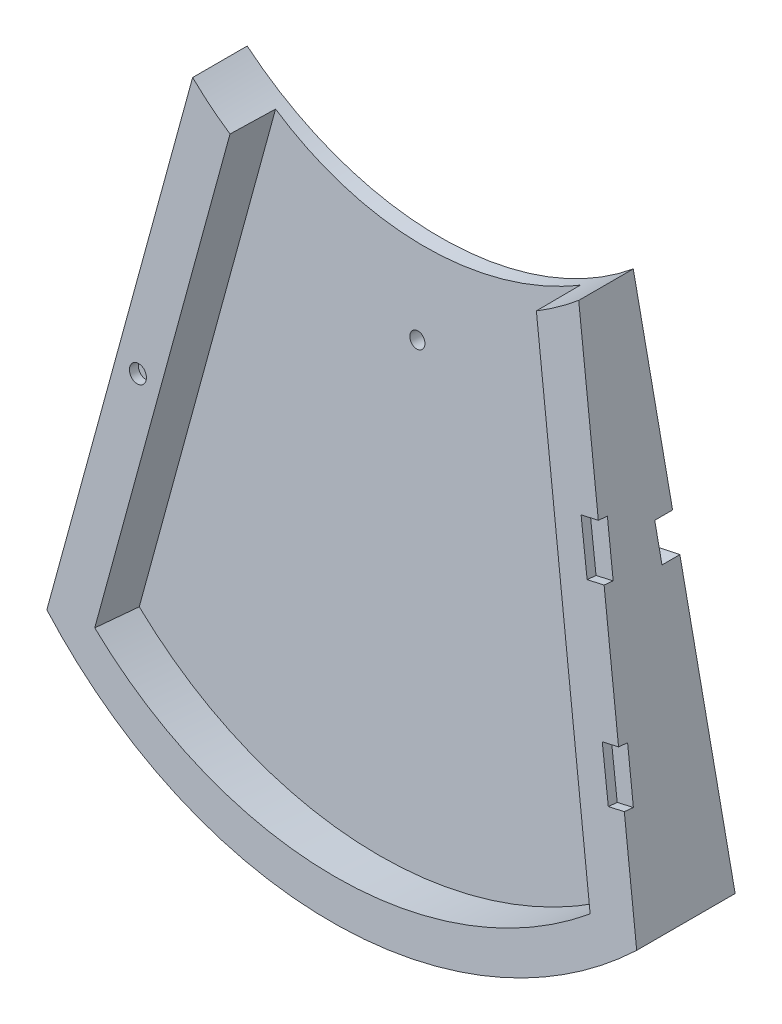
ISO-10303-21;
HEADER;
FILE_DESCRIPTION(('STEP AP214'),'2;1');
FILE_NAME('part.step','',(''),(''),'','','');
FILE_SCHEMA(('AUTOMOTIVE_DESIGN { 1 0 10303 214 1 1 1 1 }'));
ENDSEC;
DATA;
#1=APPLICATION_CONTEXT('core data for automotive mechanical design processes');
#2=APPLICATION_PROTOCOL_DEFINITION('international standard','automotive_design',2000,#1);
#3=PRODUCT_CONTEXT('',#1,'mechanical');
#4=PRODUCT('Part','Part','',(#3));
#5=PRODUCT_RELATED_PRODUCT_CATEGORY('part','',(#4));
#6=PRODUCT_DEFINITION_FORMATION('','',#4);
#7=PRODUCT_DEFINITION_CONTEXT('part definition',#1,'design');
#8=PRODUCT_DEFINITION('design','',#6,#7);
#9=PRODUCT_DEFINITION_SHAPE('','',#8);
#10=(LENGTH_UNIT() NAMED_UNIT(*) SI_UNIT(.MILLI.,.METRE.));
#11=(NAMED_UNIT(*) PLANE_ANGLE_UNIT() SI_UNIT($,.RADIAN.));
#12=(NAMED_UNIT(*) SI_UNIT($,.STERADIAN.) SOLID_ANGLE_UNIT());
#13=UNCERTAINTY_MEASURE_WITH_UNIT(LENGTH_MEASURE(1.E-05),#10,'distance_accuracy_value','');
#14=(GEOMETRIC_REPRESENTATION_CONTEXT(3) GLOBAL_UNCERTAINTY_ASSIGNED_CONTEXT((#13)) GLOBAL_UNIT_ASSIGNED_CONTEXT((#10,
#11,#12)) REPRESENTATION_CONTEXT('',''));
#15=CARTESIAN_POINT('',(0.,0.,0.));
#16=DIRECTION('',(0.,0.,1.));
#17=DIRECTION('',(1.,0.,0.));
#18=AXIS2_PLACEMENT_3D('',#15,#16,#17);
#19=CARTESIAN_POINT('',(104.775,110.670499117877,40.0181550098383));
#20=DIRECTION('',(0.,0.,-1.));
#21=DIRECTION('',(-1.,0.,0.));
#22=AXIS2_PLACEMENT_3D('',#19,#20,#21);
#23=CYLINDRICAL_SURFACE('',#22,152.4);
#24=DIRECTION('',(0.,0.,1.));
#25=VECTOR('',#24,1.);
#26=CARTESIAN_POINT('',(203.2,-5.68361286360829,-3.175));
#27=LINE('',#26,#25);
#28=CARTESIAN_POINT('',(203.2,-5.68361286360829,0.));
#29=VERTEX_POINT('',#28);
#30=CARTESIAN_POINT('',(203.2,-5.68361286360829,6.35));
#31=VERTEX_POINT('',#30);
#32=EDGE_CURVE('E290',#29,#31,#27,.T.);
#33=ORIENTED_EDGE('',*,*,#32,.F.);
#34=CARTESIAN_POINT('',(104.775,110.670499117877,0.));
#35=DIRECTION('',(0.,0.,-1.));
#36=DIRECTION('',(-1.,0.,0.));
#37=AXIS2_PLACEMENT_3D('',#34,#35,#36);
#38=CIRCLE('',#37,152.4);
#39=CARTESIAN_POINT('',(209.55,0.,0.));
#40=VERTEX_POINT('',#39);
#41=EDGE_CURVE('E378',#29,#40,#38,.F.);
#42=ORIENTED_EDGE('',*,*,#41,.T.);
#43=DIRECTION('',(0.,0.,-1.));
#44=VECTOR('',#43,1.);
#45=CARTESIAN_POINT('',(209.55,0.,40.0181550098383));
#46=LINE('',#45,#44);
#47=CARTESIAN_POINT('',(209.55,0.,34.9813640995144));
#48=VERTEX_POINT('',#47);
#49=EDGE_CURVE('E369',#48,#40,#46,.T.);
#50=ORIENTED_EDGE('',*,*,#49,.F.);
#51=CARTESIAN_POINT('',(104.775,110.670499117877,25.0649860538345));
#52=DIRECTION('',(0.,-0.0892451798673686,-0.996009687638851));
#53=DIRECTION('',(0.,0.996009687638851,-0.0892451798673686));
#54=AXIS2_PLACEMENT_3D('',#51,#52,#53);
#55=ELLIPSE('',#54,153.01055992867,152.4);
#56=CARTESIAN_POINT('',(0.,0.,34.9813640995144));
#57=VERTEX_POINT('',#56);
#58=EDGE_CURVE('E375',#57,#48,#55,.F.);
#59=ORIENTED_EDGE('',*,*,#58,.F.);
#60=DIRECTION('',(0.,0.,-1.));
#61=VECTOR('',#60,1.);
#62=CARTESIAN_POINT('',(0.,0.,40.0181550098383));
#63=LINE('',#62,#61);
#64=CARTESIAN_POINT('',(0.,0.,0.));
#65=VERTEX_POINT('',#64);
#66=EDGE_CURVE('E359',#57,#65,#63,.T.);
#67=ORIENTED_EDGE('',*,*,#66,.T.);
#68=CARTESIAN_POINT('',(6.34999999999997,-5.68361286360829,0.));
#69=VERTEX_POINT('',#68);
#70=EDGE_CURVE('E397',#65,#69,#38,.F.);
#71=ORIENTED_EDGE('',*,*,#70,.T.);
#72=DIRECTION('',(0.,0.,1.));
#73=VECTOR('',#72,1.);
#74=CARTESIAN_POINT('',(6.34999999999997,-5.68361286360829,-3.175));
#75=LINE('',#74,#73);
#76=CARTESIAN_POINT('',(6.34999999999997,-5.68361286360829,6.35));
#77=VERTEX_POINT('',#76);
#78=EDGE_CURVE('E293',#69,#77,#75,.T.);
#79=ORIENTED_EDGE('',*,*,#78,.T.);
#80=CARTESIAN_POINT('',(104.775,110.670499117877,6.35));
#81=DIRECTION('',(0.,0.,-1.));
#82=DIRECTION('',(0.,1.,0.));
#83=AXIS2_PLACEMENT_3D('',#80,#81,#82);
#84=CIRCLE('',#83,152.4);
#85=EDGE_CURVE('E11',#31,#77,#84,.T.);
#86=ORIENTED_EDGE('',*,*,#85,.F.);
#87=EDGE_LOOP('',(#33,#42,#50,#59,#67,#71,#79,#86));
#88=FACE_BOUND('',#87,.T.);
#89=ADVANCED_FACE('F34',(#88),#23,.T.);
#90=CARTESIAN_POINT('',(209.55,177.8,0.));
#91=DIRECTION('',(0.,0.,1.));
#92=DIRECTION('',(0.,-1.,0.));
#93=AXIS2_PLACEMENT_3D('',#90,#91,#92);
#94=PLANE('',#93);
#95=CARTESIAN_POINT('',(104.775,121.250876589425,0.));
#96=DIRECTION('',(0.,0.,1.));
#97=DIRECTION('',(0.,1.,0.));
#98=AXIS2_PLACEMENT_3D('',#95,#96,#97);
#99=ELLIPSE('',#98,2.67768479875172,2.667);
#100=CARTESIAN_POINT('',(104.775,123.928561388176,0.));
#101=VERTEX_POINT('',#100);
#102=EDGE_CURVE('E277',#101,#101,#99,.T.);
#103=ORIENTED_EDGE('',*,*,#102,.T.);
#104=EDGE_LOOP('',(#103));
#105=FACE_BOUND('',#104,.T.);
#106=DIRECTION('',(0.203571428571429,-0.979060096965139,0.));
#107=VECTOR('',#106,1.);
#108=CARTESIAN_POINT('',(173.355,174.076885240402,0.));
#109=LINE('',#108,#107);
#110=CARTESIAN_POINT('',(187.325,106.889315498492,0.));
#111=VERTEX_POINT('',#110);
#112=CARTESIAN_POINT('',(173.355,174.076885240402,0.));
#113=VERTEX_POINT('',#112);
#114=EDGE_CURVE('E383',#111,#113,#109,.F.);
#115=ORIENTED_EDGE('',*,*,#114,.F.);
#116=DIRECTION('',(0.97906009696514,0.203571428571426,0.));
#117=VECTOR('',#116,1.);
#118=CARTESIAN_POINT('',(176.756046253261,104.691761927064,0.));
#119=LINE('',#118,#117);
#120=CARTESIAN_POINT('',(176.756046253261,104.691761927064,0.));
#121=VERTEX_POINT('',#120);
#122=EDGE_CURVE('E267',#121,#111,#119,.T.);
#123=ORIENTED_EDGE('',*,*,#122,.F.);
#124=DIRECTION('',(-0.203571428571427,0.979060096965139,0.));
#125=VECTOR('',#124,1.);
#126=CARTESIAN_POINT('',(179.341403396118,92.2576986956065,0.));
#127=LINE('',#126,#125);
#128=CARTESIAN_POINT('',(179.341403396118,92.2576986956065,0.));
#129=VERTEX_POINT('',#128);
#130=EDGE_CURVE('E716',#129,#121,#127,.T.);
#131=ORIENTED_EDGE('',*,*,#130,.F.);
#132=DIRECTION('',(-0.97906009696514,-0.203571428571425,0.));
#133=VECTOR('',#132,1.);
#134=CARTESIAN_POINT('',(189.910357142857,94.455252267035,0.));
#135=LINE('',#134,#133);
#136=CARTESIAN_POINT('',(189.910357142857,94.455252267035,0.));
#137=VERTEX_POINT('',#136);
#138=EDGE_CURVE('E714',#137,#129,#135,.T.);
#139=ORIENTED_EDGE('',*,*,#138,.F.);
#140=EDGE_CURVE('E240',#40,#137,#109,.F.);
#141=ORIENTED_EDGE('',*,*,#140,.F.);
#142=ORIENTED_EDGE('',*,*,#41,.F.);
#143=DIRECTION('',(0.,1.,0.));
#144=VECTOR('',#143,1.);
#145=CARTESIAN_POINT('',(203.200000000001,177.8,0.));
#146=LINE('',#145,#144);
#147=CARTESIAN_POINT('',(203.2,0.66638713639168,0.));
#148=VERTEX_POINT('',#147);
#149=EDGE_CURVE('E42',#29,#148,#146,.T.);
#150=ORIENTED_EDGE('',*,*,#149,.T.);
#151=CARTESIAN_POINT('',(104.775,110.670499117877,0.));
#152=DIRECTION('',(0.,0.,1.));
#153=DIRECTION('',(0.,-1.,0.));
#154=AXIS2_PLACEMENT_3D('',#151,#152,#153);
#155=CIRCLE('',#154,147.608892949697);
#156=CARTESIAN_POINT('',(6.34999999999997,0.666387136391708,0.));
#157=VERTEX_POINT('',#156);
#158=EDGE_CURVE('E423',#148,#157,#155,.F.);
#159=ORIENTED_EDGE('',*,*,#158,.T.);
#160=DIRECTION('',(0.,-1.,0.));
#161=VECTOR('',#160,1.);
#162=CARTESIAN_POINT('',(6.34999999999997,177.8,0.));
#163=LINE('',#162,#161);
#164=EDGE_CURVE('E426',#157,#69,#163,.T.);
#165=ORIENTED_EDGE('',*,*,#164,.T.);
#166=ORIENTED_EDGE('',*,*,#70,.F.);
#167=DIRECTION('',(0.203571428571428,0.979060096965139,0.));
#168=VECTOR('',#167,1.);
#169=CARTESIAN_POINT('',(0.,0.,0.));
#170=LINE('',#169,#168);
#171=CARTESIAN_POINT('',(19.6396428571428,94.455252267035,0.));
#172=VERTEX_POINT('',#171);
#173=EDGE_CURVE('E374',#172,#65,#170,.F.);
#174=ORIENTED_EDGE('',*,*,#173,.F.);
#175=DIRECTION('',(-0.97906009696514,0.203571428571425,0.));
#176=VECTOR('',#175,1.);
#177=CARTESIAN_POINT('',(19.6396428571428,94.455252267035,0.));
#178=LINE('',#177,#176);
#179=CARTESIAN_POINT('',(30.2085966038816,92.2576986956065,0.));
#180=VERTEX_POINT('',#179);
#181=EDGE_CURVE('E261',#180,#172,#178,.T.);
#182=ORIENTED_EDGE('',*,*,#181,.F.);
#183=DIRECTION('',(-0.203571428571427,-0.979060096965139,0.));
#184=VECTOR('',#183,1.);
#185=CARTESIAN_POINT('',(30.2085966038816,92.2576986956065,0.));
#186=LINE('',#185,#184);
#187=CARTESIAN_POINT('',(32.7939537467387,104.691761927064,0.));
#188=VERTEX_POINT('',#187);
#189=EDGE_CURVE('E258',#188,#180,#186,.T.);
#190=ORIENTED_EDGE('',*,*,#189,.F.);
#191=DIRECTION('',(0.97906009696514,-0.203571428571426,0.));
#192=VECTOR('',#191,1.);
#193=CARTESIAN_POINT('',(32.7939537467387,104.691761927064,0.));
#194=LINE('',#193,#192);
#195=CARTESIAN_POINT('',(22.225,106.889315498492,0.));
#196=VERTEX_POINT('',#195);
#197=EDGE_CURVE('E250',#196,#188,#194,.T.);
#198=ORIENTED_EDGE('',*,*,#197,.F.);
#199=CARTESIAN_POINT('',(36.195,174.076885240402,0.));
#200=VERTEX_POINT('',#199);
#201=EDGE_CURVE('E379',#200,#196,#170,.F.);
#202=ORIENTED_EDGE('',*,*,#201,.F.);
#203=CARTESIAN_POINT('',(104.775,257.443461876365,0.));
#204=DIRECTION('',(0.,0.,-1.));
#205=DIRECTION('',(-1.,0.,0.));
#206=AXIS2_PLACEMENT_3D('',#203,#204,#205);
#207=CIRCLE('',#206,107.95);
#208=EDGE_CURVE('E393',#113,#200,#207,.T.);
#209=ORIENTED_EDGE('',*,*,#208,.F.);
#210=EDGE_LOOP('',(#115,#123,#131,#139,#141,#142,#150,#159,#165,#166,#174,#182,#190,#198,#202,#209));
#211=FACE_BOUND('',#210,.T.);
#212=ADVANCED_FACE('F36',(#105,#211),#94,.F.);
#213=CARTESIAN_POINT('',(209.55,0.709477537812276,34.9177929804182));
#214=DIRECTION('',(0.,-0.0892451798673686,-0.996009687638851));
#215=DIRECTION('',(0.,0.996009687638851,-0.0892451798673686));
#216=AXIS2_PLACEMENT_3D('',#213,#214,#215);
#217=PLANE('',#216);
#218=CARTESIAN_POINT('',(25.0570584627806,81.5250758393471,27.676495334401));
#219=DIRECTION('',(0.,0.0892451798673686,0.996009687638851));
#220=DIRECTION('',(0.,-0.996009687638851,0.0892451798673686));
#221=AXIS2_PLACEMENT_3D('',#218,#219,#220);
#222=CIRCLE('',#221,3.00000000000001);
#223=CARTESIAN_POINT('',(25.0570584627806,78.5370467764305,27.9442308740031));
#224=VERTEX_POINT('',#223);
#225=EDGE_CURVE('E292',#224,#224,#222,.T.);
#226=ORIENTED_EDGE('',*,*,#225,.F.);
#227=EDGE_LOOP('',(#226));
#228=FACE_BOUND('',#227,.T.);
#229=DIRECTION('',(-0.202792585399185,0.975314314577656,-0.0873908180933912));
#230=VECTOR('',#229,1.);
#231=CARTESIAN_POINT('',(209.408548292139,0.680300392770384,34.9204073320551));
#232=LINE('',#231,#230);
#233=CARTESIAN_POINT('',(198.219747424456,54.4919209100059,30.0987396197661));
#234=VERTEX_POINT('',#233);
#235=CARTESIAN_POINT('',(189.205476207381,97.8453193401935,26.2141570812811));
#236=VERTEX_POINT('',#235);
#237=EDGE_CURVE('E384',#234,#236,#232,.T.);
#238=ORIENTED_EDGE('',*,*,#237,.T.);
#239=DIRECTION('',(0.978072988710393,0.207431371561024,-0.0185864156692931));
#240=VECTOR('',#239,1.);
#241=CARTESIAN_POINT('',(183.288614458353,96.5904613059724,26.3265957777737));
#242=LINE('',#241,#240);
#243=CARTESIAN_POINT('',(183.288614458353,96.5904613059724,26.3265957777737));
#244=VERTEX_POINT('',#243);
#245=EDGE_CURVE('E308',#244,#236,#242,.T.);
#246=ORIENTED_EDGE('',*,*,#245,.F.);
#247=DIRECTION('',(0.208262403604486,-0.974170171973437,0.0872882998008739));
#248=VECTOR('',#247,1.);
#249=CARTESIAN_POINT('',(179.585708922266,113.91120696366,24.7746098073142));
#250=LINE('',#249,#248);
#251=CARTESIAN_POINT('',(179.585708922266,113.91120696366,24.7746098073142));
#252=VERTEX_POINT('',#251);
#253=EDGE_CURVE('E316',#252,#244,#250,.T.);
#254=ORIENTED_EDGE('',*,*,#253,.F.);
#255=DIRECTION('',(-0.978072988710394,-0.207431371561021,0.0185864156692931));
#256=VECTOR('',#255,1.);
#257=CARTESIAN_POINT('',(185.9701727393,115.265234834316,24.6532852234654));
#258=LINE('',#257,#256);
#259=CARTESIAN_POINT('',(185.599767720551,115.186678712268,24.6603240658871));
#260=VERTEX_POINT('',#259);
#261=EDGE_CURVE('E314',#260,#252,#258,.T.);
#262=ORIENTED_EDGE('',*,*,#261,.F.);
#263=CARTESIAN_POINT('',(173.355,174.076885240402,19.3836012194569));
#264=VERTEX_POINT('',#263);
#265=EDGE_CURVE('E385',#260,#264,#232,.T.);
#266=ORIENTED_EDGE('',*,*,#265,.T.);
#267=CARTESIAN_POINT('',(104.775,257.443461876365,11.9137289690767));
#268=DIRECTION('',(0.,-0.0892451798673686,-0.996009687638851));
#269=DIRECTION('',(0.,0.996009687638851,-0.0892451798673686));
#270=AXIS2_PLACEMENT_3D('',#267,#268,#269);
#271=ELLIPSE('',#270,108.382479949474,107.95);
#272=CARTESIAN_POINT('',(159.193943589174,164.213739798917,20.2673659055917));
#273=VERTEX_POINT('',#272);
#274=EDGE_CURVE('E386',#264,#273,#271,.T.);
#275=ORIENTED_EDGE('',*,*,#274,.T.);
#276=DIRECTION('',(-0.202792585399185,0.975314314577655,-0.0873908180933912));
#277=VECTOR('',#276,1.);
#278=CARTESIAN_POINT('',(192.776407619951,2.70163212726763,34.739290505125));
#279=LINE('',#278,#277);
#280=CARTESIAN_POINT('',(192.776407619951,2.70163212726762,34.739290505125));
#281=VERTEX_POINT('',#280);
#282=EDGE_CURVE('E346',#281,#273,#279,.T.);
#283=ORIENTED_EDGE('',*,*,#282,.F.);
#284=CARTESIAN_POINT('',(104.775,110.670499117877,25.0649860538346));
#285=DIRECTION('',(0.,0.0892451798673686,0.996009687638851));
#286=DIRECTION('',(0.,-0.996009687638851,0.0892451798673686));
#287=AXIS2_PLACEMENT_3D('',#284,#285,#286);
#288=CIRCLE('',#287,139.624912350715);
#289=CARTESIAN_POINT('',(16.7735923800494,2.70163212726762,34.739290505125));
#290=VERTEX_POINT('',#289);
#291=EDGE_CURVE('E353',#290,#281,#288,.T.);
#292=ORIENTED_EDGE('',*,*,#291,.F.);
#293=DIRECTION('',(-0.202792585399184,-0.975314314577656,0.0873908180933912));
#294=VECTOR('',#293,1.);
#295=CARTESIAN_POINT('',(92.0294252752799,364.638390977217,2.30877145992429));
#296=LINE('',#295,#294);
#297=CARTESIAN_POINT('',(50.3560564108256,164.213739798917,20.2673659055917));
#298=VERTEX_POINT('',#297);
#299=EDGE_CURVE('E323',#298,#290,#296,.T.);
#300=ORIENTED_EDGE('',*,*,#299,.F.);
#301=CARTESIAN_POINT('',(36.195,174.076885240402,19.3836012194569));
#302=VERTEX_POINT('',#301);
#303=EDGE_CURVE('E390',#298,#302,#271,.T.);
#304=ORIENTED_EDGE('',*,*,#303,.T.);
#305=DIRECTION('',(-0.202792585399184,-0.975314314577656,0.0873908180933912));
#306=VECTOR('',#305,1.);
#307=CARTESIAN_POINT('',(8.75916039865485,42.1264638629345,31.2067182388539));
#308=LINE('',#307,#306);
#309=EDGE_CURVE('E371',#302,#57,#308,.T.);
#310=ORIENTED_EDGE('',*,*,#309,.T.);
#311=ORIENTED_EDGE('',*,*,#58,.T.);
#312=CARTESIAN_POINT('',(201.825455911286,37.1505615379309,31.6525726351602));
#313=VERTEX_POINT('',#312);
#314=EDGE_CURVE('E380',#48,#313,#232,.T.);
#315=ORIENTED_EDGE('',*,*,#314,.T.);
#316=DIRECTION('',(0.978072988710394,0.207431371561019,-0.0185864156692921));
#317=VECTOR('',#316,1.);
#318=CARTESIAN_POINT('',(196.248783834661,35.9678515040655,31.7585466743821));
#319=LINE('',#318,#317);
#320=CARTESIAN_POINT('',(196.248783834661,35.9678515040655,31.7585466743821));
#321=VERTEX_POINT('',#320);
#322=EDGE_CURVE('E329',#321,#313,#319,.T.);
#323=ORIENTED_EDGE('',*,*,#322,.F.);
#324=DIRECTION('',(0.208262403604485,-0.974170171973437,0.0872882998008739));
#325=VECTOR('',#324,1.);
#326=CARTESIAN_POINT('',(192.545878298573,53.2885971617532,30.2065607039225));
#327=LINE('',#326,#325);
#328=CARTESIAN_POINT('',(192.545878298573,53.2885971617532,30.2065607039225));
#329=VERTEX_POINT('',#328);
#330=EDGE_CURVE('E336',#329,#321,#327,.T.);
#331=ORIENTED_EDGE('',*,*,#330,.F.);
#332=DIRECTION('',(-0.978072988710394,-0.207431371561019,0.0185864156692921));
#333=VECTOR('',#332,1.);
#334=CARTESIAN_POINT('',(198.756641776884,54.6057863711657,30.0885369644225));
#335=LINE('',#334,#333);
#336=EDGE_CURVE('E302',#234,#329,#335,.T.);
#337=ORIENTED_EDGE('',*,*,#336,.F.);
#338=EDGE_LOOP('',(#238,#246,#254,#262,#266,#275,#283,#292,#300,#304,#310,#311,#315,#323,#331,#337));
#339=FACE_BOUND('',#338,.T.);
#340=ADVANCED_FACE('F466',(#228,#339),#217,.F.);
#341=CARTESIAN_POINT('',(104.775,257.443461876365,40.0181550098383));
#342=DIRECTION('',(0.,0.,-1.));
#343=DIRECTION('',(-1.,0.,0.));
#344=AXIS2_PLACEMENT_3D('',#341,#342,#343);
#345=CYLINDRICAL_SURFACE('',#344,107.95);
#346=CARTESIAN_POINT('',(104.775,257.443461876365,-4.02487102349307));
#347=DIRECTION('',(0.,0.0892451798673686,0.996009687638851));
#348=DIRECTION('',(0.,0.996009687638851,-0.0892451798673686));
#349=AXIS2_PLACEMENT_3D('',#346,#347,#348);
#350=ELLIPSE('',#349,108.382479949474,107.95);
#351=CARTESIAN_POINT('',(158.931152965407,164.060842530004,4.34246592461291));
#352=VERTEX_POINT('',#351);
#353=CARTESIAN_POINT('',(50.618847034593,164.060842530004,4.3424659246129));
#354=VERTEX_POINT('',#353);
#355=EDGE_CURVE('E389',#352,#354,#350,.F.);
#356=ORIENTED_EDGE('',*,*,#355,.F.);
#357=CARTESIAN_POINT('',(104.775,257.443461876365,-1883.63695862269));
#358=DIRECTION('',(0.979221715091692,0.201983379638917,-0.0180982607597189));
#359=DIRECTION('',(-0.0177251130832414,-0.0036561467028944,-0.999836213065657));
#360=AXIS2_PLACEMENT_3D('',#357,#358,#359);
#361=ELLIPSE('',#360,5964.66154583554,107.95);
#362=EDGE_CURVE('E404',#352,#273,#361,.F.);
#363=ORIENTED_EDGE('',*,*,#362,.T.);
#364=ORIENTED_EDGE('',*,*,#274,.F.);
#365=DIRECTION('',(0.,0.,-1.));
#366=VECTOR('',#365,1.);
#367=CARTESIAN_POINT('',(173.355,174.076885240402,40.0181550098383));
#368=LINE('',#367,#366);
#369=EDGE_CURVE('E364',#264,#113,#368,.T.);
#370=ORIENTED_EDGE('',*,*,#369,.T.);
#371=ORIENTED_EDGE('',*,*,#208,.T.);
#372=DIRECTION('',(0.,0.,-1.));
#373=VECTOR('',#372,1.);
#374=CARTESIAN_POINT('',(36.195,174.076885240402,40.0181550098383));
#375=LINE('',#374,#373);
#376=EDGE_CURVE('E362',#302,#200,#375,.T.);
#377=ORIENTED_EDGE('',*,*,#376,.F.);
#378=ORIENTED_EDGE('',*,*,#303,.F.);
#379=CARTESIAN_POINT('',(104.775,257.443461876365,-1883.6369586227));
#380=DIRECTION('',(-0.979221715091692,0.201983379638917,-0.0180982607597189));
#381=DIRECTION('',(0.0177251130832414,-0.00365614670289439,-0.999836213065657));
#382=AXIS2_PLACEMENT_3D('',#379,#380,#381);
#383=ELLIPSE('',#382,5964.66154583555,107.95);
#384=EDGE_CURVE('E401',#298,#354,#383,.F.);
#385=ORIENTED_EDGE('',*,*,#384,.T.);
#386=EDGE_LOOP('',(#356,#363,#364,#370,#371,#377,#378,#385));
#387=FACE_BOUND('',#386,.T.);
#388=ADVANCED_FACE('F471',(#387),#345,.F.);
#389=CARTESIAN_POINT('',(173.355,174.076885240402,40.0181550098383));
#390=DIRECTION('',(-0.979060096965139,-0.203571428571429,0.));
#391=DIRECTION('',(0.203571428571429,-0.979060096965139,0.));
#392=AXIS2_PLACEMENT_3D('',#389,#390,#391);
#393=PLANE('',#392);
#394=DIRECTION('',(0.203571428571429,-0.979060096965139,0.));
#395=VECTOR('',#394,1.);
#396=CARTESIAN_POINT('',(187.325,106.889315498492,6.35));
#397=LINE('',#396,#395);
#398=CARTESIAN_POINT('',(187.325,106.889315498492,6.35));
#399=VERTEX_POINT('',#398);
#400=CARTESIAN_POINT('',(189.910357142857,94.455252267035,6.35));
#401=VERTEX_POINT('',#400);
#402=EDGE_CURVE('E229',#399,#401,#397,.T.);
#403=ORIENTED_EDGE('',*,*,#402,.F.);
#404=DIRECTION('',(0.,0.,-1.));
#405=VECTOR('',#404,1.);
#406=CARTESIAN_POINT('',(187.325,106.889315498492,6.35));
#407=LINE('',#406,#405);
#408=EDGE_CURVE('E241',#399,#111,#407,.T.);
#409=ORIENTED_EDGE('',*,*,#408,.T.);
#410=ORIENTED_EDGE('',*,*,#114,.T.);
#411=ORIENTED_EDGE('',*,*,#369,.F.);
#412=ORIENTED_EDGE('',*,*,#265,.F.);
#413=DIRECTION('',(0.0177696813453731,-0.0854618256752871,-0.996182972539247));
#414=VECTOR('',#413,1.);
#415=CARTESIAN_POINT('',(185.234606812971,116.942890161451,45.1315453162));
#416=LINE('',#415,#414);
#417=CARTESIAN_POINT('',(185.656195772424,114.915292622746,21.4969209999025));
#418=VERTEX_POINT('',#417);
#419=EDGE_CURVE('E417',#260,#418,#416,.T.);
#420=ORIENTED_EDGE('',*,*,#419,.T.);
#421=DIRECTION('',(-0.202792585399185,0.975314314577656,-0.0873908180933913));
#422=VECTOR('',#421,1.);
#423=CARTESIAN_POINT('',(173.777183337366,172.046429089853,16.3778156203945));
#424=LINE('',#423,#422);
#425=CARTESIAN_POINT('',(189.261904259254,97.5739332506715,23.0507540152965));
#426=VERTEX_POINT('',#425);
#427=EDGE_CURVE('E415',#426,#418,#424,.T.);
#428=ORIENTED_EDGE('',*,*,#427,.F.);
#429=DIRECTION('',(-0.0177696813453731,0.0854618256752871,0.996182972539247));
#430=VECTOR('',#429,1.);
#431=CARTESIAN_POINT('',(188.840347382421,99.6013764906447,46.6835797534804));
#432=LINE('',#431,#430);
#433=EDGE_CURVE('E420',#426,#236,#432,.T.);
#434=ORIENTED_EDGE('',*,*,#433,.T.);
#435=ORIENTED_EDGE('',*,*,#237,.F.);
#436=DIRECTION('',(0.0177696813453731,-0.0854618256752872,-0.996182972539247));
#437=VECTOR('',#436,1.);
#438=CARTESIAN_POINT('',(197.854698806047,56.2475923136279,50.5636658466816));
#439=LINE('',#438,#437);
#440=CARTESIAN_POINT('',(198.276175476329,54.2205348204839,26.9353365537815));
#441=VERTEX_POINT('',#440);
#442=EDGE_CURVE('E409',#234,#441,#439,.T.);
#443=ORIENTED_EDGE('',*,*,#442,.T.);
#444=DIRECTION('',(-0.202792585399185,0.975314314577656,-0.0873908180933912));
#445=VECTOR('',#444,1.);
#446=CARTESIAN_POINT('',(173.777183337366,172.046429089853,16.3778156203945));
#447=LINE('',#446,#445);
#448=CARTESIAN_POINT('',(201.88188396316,36.8791754484089,28.4891695691755));
#449=VERTEX_POINT('',#448);
#450=EDGE_CURVE('E407',#449,#441,#447,.T.);
#451=ORIENTED_EDGE('',*,*,#450,.F.);
#452=DIRECTION('',(-0.0177696813453731,0.0854618256752872,0.996182972539247));
#453=VECTOR('',#452,1.);
#454=CARTESIAN_POINT('',(201.460439375497,38.9060786428212,52.115700283962));
#455=LINE('',#454,#453);
#456=EDGE_CURVE('E412',#449,#313,#455,.T.);
#457=ORIENTED_EDGE('',*,*,#456,.T.);
#458=ORIENTED_EDGE('',*,*,#314,.F.);
#459=ORIENTED_EDGE('',*,*,#49,.T.);
#460=ORIENTED_EDGE('',*,*,#140,.T.);
#461=DIRECTION('',(0.,0.,-1.));
#462=VECTOR('',#461,1.);
#463=CARTESIAN_POINT('',(189.910357142857,94.455252267035,6.35));
#464=LINE('',#463,#462);
#465=EDGE_CURVE('E224',#401,#137,#464,.T.);
#466=ORIENTED_EDGE('',*,*,#465,.F.);
#467=EDGE_LOOP('',(#403,#409,#410,#411,#412,#420,#428,#434,#435,#443,#451,#457,#458,#459,#460,#466));
#468=FACE_BOUND('',#467,.T.);
#469=ADVANCED_FACE('F237',(#468),#393,.F.);
#470=CARTESIAN_POINT('',(0.,0.,40.0181550098383));
#471=DIRECTION('',(0.979060096965139,-0.203571428571428,0.));
#472=DIRECTION('',(0.203571428571428,0.979060096965139,0.));
#473=AXIS2_PLACEMENT_3D('',#470,#471,#472);
#474=PLANE('',#473);
#475=ORIENTED_EDGE('',*,*,#201,.T.);
#476=DIRECTION('',(0.,0.,-1.));
#477=VECTOR('',#476,1.);
#478=CARTESIAN_POINT('',(22.225,106.889315498492,6.35));
#479=LINE('',#478,#477);
#480=CARTESIAN_POINT('',(22.225,106.889315498492,6.35));
#481=VERTEX_POINT('',#480);
#482=EDGE_CURVE('E268',#481,#196,#479,.T.);
#483=ORIENTED_EDGE('',*,*,#482,.F.);
#484=DIRECTION('',(0.203571428571429,0.979060096965139,0.));
#485=VECTOR('',#484,1.);
#486=CARTESIAN_POINT('',(22.225,106.889315498492,6.35));
#487=LINE('',#486,#485);
#488=CARTESIAN_POINT('',(19.6396428571428,94.455252267035,6.35));
#489=VERTEX_POINT('',#488);
#490=EDGE_CURVE('E252',#489,#481,#487,.T.);
#491=ORIENTED_EDGE('',*,*,#490,.F.);
#492=DIRECTION('',(0.,0.,-1.));
#493=VECTOR('',#492,1.);
#494=CARTESIAN_POINT('',(19.6396428571428,94.455252267035,6.35));
#495=LINE('',#494,#493);
#496=EDGE_CURVE('E270',#489,#172,#495,.T.);
#497=ORIENTED_EDGE('',*,*,#496,.T.);
#498=ORIENTED_EDGE('',*,*,#173,.T.);
#499=ORIENTED_EDGE('',*,*,#66,.F.);
#500=ORIENTED_EDGE('',*,*,#309,.F.);
#501=ORIENTED_EDGE('',*,*,#376,.T.);
#502=EDGE_LOOP('',(#475,#483,#491,#497,#498,#499,#500,#501));
#503=FACE_BOUND('',#502,.T.);
#504=ADVANCED_FACE('F501',(#503),#474,.F.);
#505=CARTESIAN_POINT('',(192.776407619951,1.28486489687315,18.9276367138582));
#506=DIRECTION('',(0.979221715091692,0.201983379638917,-0.0180982607597189));
#507=DIRECTION('',(-0.202016467296782,0.979382125087511,0.));
#508=AXIS2_PLACEMENT_3D('',#505,#506,#507);
#509=PLANE('',#508);
#510=DIRECTION('',(-0.202792585399185,0.975314314577655,-0.0873908180933912));
#511=VECTOR('',#510,1.);
#512=CARTESIAN_POINT('',(192.776407619951,1.28486489687315,18.9276367138582));
#513=LINE('',#512,#511);
#514=CARTESIAN_POINT('',(192.776407619951,1.28486489687315,18.9276367138582));
#515=VERTEX_POINT('',#514);
#516=EDGE_CURVE('E349',#515,#352,#513,.T.);
#517=ORIENTED_EDGE('',*,*,#516,.F.);
#518=DIRECTION('',(0.,0.0892451798673686,0.996009687638851));
#519=VECTOR('',#518,1.);
#520=CARTESIAN_POINT('',(192.776407619951,1.28486489687315,18.9276367138582));
#521=LINE('',#520,#519);
#522=EDGE_CURVE('E357',#515,#281,#521,.T.);
#523=ORIENTED_EDGE('',*,*,#522,.T.);
#524=ORIENTED_EDGE('',*,*,#282,.T.);
#525=ORIENTED_EDGE('',*,*,#362,.F.);
#526=EDGE_LOOP('',(#517,#523,#524,#525));
#527=FACE_BOUND('',#526,.T.);
#528=ADVANCED_FACE('F517',(#527),#509,.F.);
#529=CARTESIAN_POINT('',(92.0294252752799,363.221623746823,-13.5028823313425));
#530=DIRECTION('',(-0.979221715091692,0.201983379638917,-0.0180982607597189));
#531=DIRECTION('',(-0.202016467296782,-0.979382125087511,0.));
#532=AXIS2_PLACEMENT_3D('',#529,#530,#531);
#533=PLANE('',#532);
#534=ORIENTED_EDGE('',*,*,#299,.T.);
#535=DIRECTION('',(0.,0.0892451798673686,0.996009687638851));
#536=VECTOR('',#535,1.);
#537=CARTESIAN_POINT('',(16.7735923800494,1.28486489687314,18.9276367138582));
#538=LINE('',#537,#536);
#539=CARTESIAN_POINT('',(16.7735923800494,1.28486489687314,18.9276367138582));
#540=VERTEX_POINT('',#539);
#541=EDGE_CURVE('E351',#540,#290,#538,.T.);
#542=ORIENTED_EDGE('',*,*,#541,.F.);
#543=DIRECTION('',(-0.202792585399184,-0.975314314577656,0.0873908180933912));
#544=VECTOR('',#543,1.);
#545=CARTESIAN_POINT('',(92.0294252752799,363.221623746823,-13.5028823313425));
#546=LINE('',#545,#544);
#547=EDGE_CURVE('E343',#354,#540,#546,.T.);
#548=ORIENTED_EDGE('',*,*,#547,.F.);
#549=ORIENTED_EDGE('',*,*,#384,.F.);
#550=EDGE_LOOP('',(#534,#542,#548,#549));
#551=FACE_BOUND('',#550,.T.);
#552=ADVANCED_FACE('F508',(#551),#533,.F.);
#553=CARTESIAN_POINT('',(104.775,109.253731887483,9.25333226256779));
#554=DIRECTION('',(0.,0.0892451798673686,0.996009687638851));
#555=DIRECTION('',(0.,-0.996009687638851,0.0892451798673686));
#556=AXIS2_PLACEMENT_3D('',#553,#554,#555);
#557=PLANE('',#556);
#558=CARTESIAN_POINT('',(104.775,121.977842946606,8.11321726748596));
#559=DIRECTION('',(0.,0.0892451798673687,0.996009687638851));
#560=DIRECTION('',(0.,-0.996009687638851,0.0892451798673687));
#561=AXIS2_PLACEMENT_3D('',#558,#559,#560);
#562=CIRCLE('',#561,2.667);
#563=CARTESIAN_POINT('',(104.775,119.321485109673,8.35123416219223));
#564=VERTEX_POINT('',#563);
#565=EDGE_CURVE('E274',#564,#564,#562,.T.);
#566=ORIENTED_EDGE('',*,*,#565,.F.);
#567=EDGE_LOOP('',(#566));
#568=FACE_BOUND('',#567,.T.);
#569=ORIENTED_EDGE('',*,*,#355,.T.);
#570=ORIENTED_EDGE('',*,*,#547,.T.);
#571=CARTESIAN_POINT('',(104.775,109.253731887483,9.25333226256779));
#572=DIRECTION('',(0.,0.0892451798673686,0.996009687638851));
#573=DIRECTION('',(0.,-0.996009687638851,0.0892451798673686));
#574=AXIS2_PLACEMENT_3D('',#571,#572,#573);
#575=CIRCLE('',#574,139.624912350715);
#576=EDGE_CURVE('E345',#540,#515,#575,.T.);
#577=ORIENTED_EDGE('',*,*,#576,.T.);
#578=ORIENTED_EDGE('',*,*,#516,.T.);
#579=EDGE_LOOP('',(#569,#570,#577,#578));
#580=FACE_BOUND('',#579,.T.);
#581=ADVANCED_FACE('F515',(#568,#580),#557,.T.);
#582=CARTESIAN_POINT('',(104.775,109.253731887483,9.25333226256779));
#583=DIRECTION('',(0.,0.0892451798673686,0.996009687638851));
#584=DIRECTION('',(0.,-0.996009687638851,0.0892451798673686));
#585=AXIS2_PLACEMENT_3D('',#582,#583,#584);
#586=CYLINDRICAL_SURFACE('',#585,139.624912350715);
#587=ORIENTED_EDGE('',*,*,#291,.T.);
#588=ORIENTED_EDGE('',*,*,#522,.F.);
#589=ORIENTED_EDGE('',*,*,#576,.F.);
#590=ORIENTED_EDGE('',*,*,#541,.T.);
#591=EDGE_LOOP('',(#587,#588,#589,#590));
#592=FACE_BOUND('',#591,.T.);
#593=ADVANCED_FACE('F512',(#592),#586,.F.);
#594=CARTESIAN_POINT('',(196.248783834661,35.6844980579866,28.5962159161287));
#595=DIRECTION('',(0.208262403604484,-0.974170171973437,0.0872882998008739));
#596=DIRECTION('',(0.977902736786472,0.209060367802051,0.));
#597=AXIS2_PLACEMENT_3D('',#594,#595,#596);
#598=PLANE('',#597);
#599=DIRECTION('',(0.978072988710394,0.207431371561019,-0.0185864156692921));
#600=VECTOR('',#599,1.);
#601=CARTESIAN_POINT('',(196.248783834661,35.6844980579866,28.5962159161287));
#602=LINE('',#601,#600);
#603=CARTESIAN_POINT('',(196.248783834661,35.6844980579866,28.5962159161287));
#604=VERTEX_POINT('',#603);
#605=EDGE_CURVE('E332',#604,#449,#602,.T.);
#606=ORIENTED_EDGE('',*,*,#605,.F.);
#607=DIRECTION('',(0.,0.0892451798673686,0.996009687638851));
#608=VECTOR('',#607,1.);
#609=CARTESIAN_POINT('',(196.248783834661,35.6844980579866,28.5962159161287));
#610=LINE('',#609,#608);
#611=EDGE_CURVE('E317',#604,#321,#610,.T.);
#612=ORIENTED_EDGE('',*,*,#611,.T.);
#613=ORIENTED_EDGE('',*,*,#322,.T.);
#614=ORIENTED_EDGE('',*,*,#456,.F.);
#615=EDGE_LOOP('',(#606,#612,#613,#614));
#616=FACE_BOUND('',#615,.T.);
#617=ADVANCED_FACE('F530',(#616),#598,.F.);
#618=CARTESIAN_POINT('',(198.756641776884,54.3224329250868,26.9262062061692));
#619=DIRECTION('',(-0.208262403604484,0.974170171973437,-0.0872882998008739));
#620=DIRECTION('',(-0.977902736786472,-0.209060367802051,0.));
#621=AXIS2_PLACEMENT_3D('',#618,#619,#620);
#622=PLANE('',#621);
#623=ORIENTED_EDGE('',*,*,#336,.T.);
#624=DIRECTION('',(0.,0.0892451798673686,0.996009687638851));
#625=VECTOR('',#624,1.);
#626=CARTESIAN_POINT('',(192.545878298573,53.0052437156743,27.0442299456692));
#627=LINE('',#626,#625);
#628=CARTESIAN_POINT('',(192.545878298573,53.0052437156743,27.0442299456692));
#629=VERTEX_POINT('',#628);
#630=EDGE_CURVE('E334',#629,#329,#627,.T.);
#631=ORIENTED_EDGE('',*,*,#630,.F.);
#632=DIRECTION('',(-0.978072988710394,-0.207431371561019,0.0185864156692921));
#633=VECTOR('',#632,1.);
#634=CARTESIAN_POINT('',(198.756641776884,54.3224329250868,26.9262062061692));
#635=LINE('',#634,#633);
#636=EDGE_CURVE('E326',#441,#629,#635,.T.);
#637=ORIENTED_EDGE('',*,*,#636,.F.);
#638=ORIENTED_EDGE('',*,*,#442,.F.);
#639=EDGE_LOOP('',(#623,#631,#637,#638));
#640=FACE_BOUND('',#639,.T.);
#641=ADVANCED_FACE('F535',(#640),#622,.F.);
#642=CARTESIAN_POINT('',(0.,2.82610725647928,31.5404171961227));
#643=DIRECTION('',(0.,0.0892451798673685,0.996009687638851));
#644=DIRECTION('',(0.,-0.996009687638851,0.0892451798673685));
#645=AXIS2_PLACEMENT_3D('',#642,#643,#644);
#646=PLANE('',#645);
#647=ORIENTED_EDGE('',*,*,#450,.T.);
#648=ORIENTED_EDGE('',*,*,#636,.T.);
#649=DIRECTION('',(0.208262403604485,-0.974170171973437,0.0872882998008739));
#650=VECTOR('',#649,1.);
#651=CARTESIAN_POINT('',(192.545878298573,53.0052437156743,27.0442299456692));
#652=LINE('',#651,#650);
#653=EDGE_CURVE('E328',#629,#604,#652,.T.);
#654=ORIENTED_EDGE('',*,*,#653,.T.);
#655=ORIENTED_EDGE('',*,*,#605,.T.);
#656=EDGE_LOOP('',(#647,#648,#654,#655));
#657=FACE_BOUND('',#656,.T.);
#658=ADVANCED_FACE('F690',(#657),#646,.T.);
#659=CARTESIAN_POINT('',(192.545878298573,53.0052437156743,27.0442299456692));
#660=DIRECTION('',(-0.978072988710394,-0.207431371561019,0.0185864156692927));
#661=DIRECTION('',(0.207467209933098,-0.978241972521408,0.));
#662=AXIS2_PLACEMENT_3D('',#659,#660,#661);
#663=PLANE('',#662);
#664=ORIENTED_EDGE('',*,*,#330,.T.);
#665=ORIENTED_EDGE('',*,*,#611,.F.);
#666=ORIENTED_EDGE('',*,*,#653,.F.);
#667=ORIENTED_EDGE('',*,*,#630,.T.);
#668=EDGE_LOOP('',(#664,#665,#666,#667));
#669=FACE_BOUND('',#668,.T.);
#670=ADVANCED_FACE('F682',(#669),#663,.F.);
#671=CARTESIAN_POINT('',(183.288614458353,96.3071078598935,23.1642650195203));
#672=DIRECTION('',(0.20826240360449,-0.974170171973436,0.0872882998008738));
#673=DIRECTION('',(0.97790273678647,0.209060367802057,0.));
#674=AXIS2_PLACEMENT_3D('',#671,#672,#673);
#675=PLANE('',#674);
#676=DIRECTION('',(0.978072988710393,0.207431371561024,-0.0185864156692931));
#677=VECTOR('',#676,1.);
#678=CARTESIAN_POINT('',(183.288614458353,96.3071078598935,23.1642650195203));
#679=LINE('',#678,#677);
#680=CARTESIAN_POINT('',(183.288614458353,96.3071078598935,23.1642650195203));
#681=VERTEX_POINT('',#680);
#682=EDGE_CURVE('E311',#681,#426,#679,.T.);
#683=ORIENTED_EDGE('',*,*,#682,.F.);
#684=DIRECTION('',(0.,0.0892451798673686,0.996009687638851));
#685=VECTOR('',#684,1.);
#686=CARTESIAN_POINT('',(183.288614458353,96.3071078598935,23.1642650195203));
#687=LINE('',#686,#685);
#688=EDGE_CURVE('E321',#681,#244,#687,.T.);
#689=ORIENTED_EDGE('',*,*,#688,.T.);
#690=ORIENTED_EDGE('',*,*,#245,.T.);
#691=ORIENTED_EDGE('',*,*,#433,.F.);
#692=EDGE_LOOP('',(#683,#689,#690,#691));
#693=FACE_BOUND('',#692,.T.);
#694=ADVANCED_FACE('F679',(#693),#675,.F.);
#695=CARTESIAN_POINT('',(185.9701727393,114.981881388237,21.4909544652121));
#696=DIRECTION('',(-0.208262403604487,0.974170171973436,-0.0872882998008739));
#697=DIRECTION('',(-0.977902736786471,-0.209060367802054,0.));
#698=AXIS2_PLACEMENT_3D('',#695,#696,#697);
#699=PLANE('',#698);
#700=ORIENTED_EDGE('',*,*,#261,.T.);
#701=DIRECTION('',(0.,0.0892451798673686,0.996009687638851));
#702=VECTOR('',#701,1.);
#703=CARTESIAN_POINT('',(179.585708922266,113.627853517581,21.6122790490608));
#704=LINE('',#703,#702);
#705=CARTESIAN_POINT('',(179.585708922266,113.627853517581,21.6122790490608));
#706=VERTEX_POINT('',#705);
#707=EDGE_CURVE('E313',#706,#252,#704,.T.);
#708=ORIENTED_EDGE('',*,*,#707,.F.);
#709=DIRECTION('',(-0.978072988710394,-0.207431371561021,0.0185864156692931));
#710=VECTOR('',#709,1.);
#711=CARTESIAN_POINT('',(185.9701727393,114.981881388237,21.4909544652121));
#712=LINE('',#711,#710);
#713=EDGE_CURVE('E305',#418,#706,#712,.T.);
#714=ORIENTED_EDGE('',*,*,#713,.F.);
#715=ORIENTED_EDGE('',*,*,#419,.F.);
#716=EDGE_LOOP('',(#700,#708,#714,#715));
#717=FACE_BOUND('',#716,.T.);
#718=ADVANCED_FACE('F677',(#717),#699,.F.);
#719=CARTESIAN_POINT('',(0.,2.8261072564793,31.5404171961228));
#720=DIRECTION('',(0.,0.0892451798673687,0.996009687638851));
#721=DIRECTION('',(0.,-0.996009687638851,0.0892451798673687));
#722=AXIS2_PLACEMENT_3D('',#719,#720,#721);
#723=PLANE('',#722);
#724=ORIENTED_EDGE('',*,*,#427,.T.);
#725=ORIENTED_EDGE('',*,*,#713,.T.);
#726=DIRECTION('',(0.208262403604486,-0.974170171973437,0.0872882998008739));
#727=VECTOR('',#726,1.);
#728=CARTESIAN_POINT('',(179.585708922266,113.627853517581,21.6122790490608));
#729=LINE('',#728,#727);
#730=EDGE_CURVE('E307',#706,#681,#729,.T.);
#731=ORIENTED_EDGE('',*,*,#730,.T.);
#732=ORIENTED_EDGE('',*,*,#682,.T.);
#733=EDGE_LOOP('',(#724,#725,#731,#732));
#734=FACE_BOUND('',#733,.T.);
#735=ADVANCED_FACE('F674',(#734),#723,.T.);
#736=CARTESIAN_POINT('',(179.585708922266,113.627853517581,21.6122790490608));
#737=DIRECTION('',(-0.978072988710394,-0.207431371561021,0.0185864156692929));
#738=DIRECTION('',(0.2074672099331,-0.978241972521408,0.));
#739=AXIS2_PLACEMENT_3D('',#736,#737,#738);
#740=PLANE('',#739);
#741=ORIENTED_EDGE('',*,*,#253,.T.);
#742=ORIENTED_EDGE('',*,*,#688,.F.);
#743=ORIENTED_EDGE('',*,*,#730,.F.);
#744=ORIENTED_EDGE('',*,*,#707,.T.);
#745=EDGE_LOOP('',(#741,#742,#743,#744));
#746=FACE_BOUND('',#745,.T.);
#747=ADVANCED_FACE('F670',(#746),#740,.F.);
#748=CARTESIAN_POINT('',(25.0570584627806,81.2417223932682,24.5141645761477));
#749=DIRECTION('',(0.,0.0892451798673686,0.996009687638851));
#750=DIRECTION('',(0.,-0.996009687638851,0.0892451798673686));
#751=AXIS2_PLACEMENT_3D('',#748,#749,#750);
#752=CYLINDRICAL_SURFACE('',#751,3.00000000000001);
#753=CARTESIAN_POINT('',(25.0570584627806,81.2417223932682,24.5141645761477));
#754=DIRECTION('',(0.,0.0892451798673686,0.996009687638851));
#755=DIRECTION('',(0.,-0.996009687638851,0.0892451798673686));
#756=AXIS2_PLACEMENT_3D('',#753,#754,#755);
#757=CIRCLE('',#756,3.00000000000001);
#758=CARTESIAN_POINT('',(25.0570584627806,78.2536933303516,24.7819001157498));
#759=VERTEX_POINT('',#758);
#760=EDGE_CURVE('E299',#759,#759,#757,.T.);
#761=ORIENTED_EDGE('',*,*,#760,.F.);
#762=EDGE_LOOP('',(#761));
#763=FACE_BOUND('',#762,.T.);
#764=ORIENTED_EDGE('',*,*,#225,.T.);
#765=EDGE_LOOP('',(#764));
#766=FACE_BOUND('',#765,.T.);
#767=ADVANCED_FACE('F664',(#763,#766),#752,.F.);
#768=CARTESIAN_POINT('',(25.0570584627806,81.2417223932682,24.5141645761477));
#769=DIRECTION('',(0.,0.0892451798673686,0.996009687638851));
#770=DIRECTION('',(0.,-0.996009687638851,0.0892451798673686));
#771=AXIS2_PLACEMENT_3D('',#768,#769,#770);
#772=PLANE('',#771);
#773=ORIENTED_EDGE('',*,*,#760,.T.);
#774=EDGE_LOOP('',(#773));
#775=FACE_BOUND('',#774,.T.);
#776=ADVANCED_FACE('F659',(#775),#772,.T.);
#777=CARTESIAN_POINT('',(104.775,110.670499117877,6.35));
#778=DIRECTION('',(0.,0.,-1.));
#779=DIRECTION('',(0.,1.,0.));
#780=AXIS2_PLACEMENT_3D('',#777,#778,#779);
#781=PLANE('',#780);
#782=ORIENTED_EDGE('',*,*,#85,.T.);
#783=DIRECTION('',(0.,-1.,0.));
#784=VECTOR('',#783,1.);
#785=CARTESIAN_POINT('',(6.34999999999997,0.666387136391713,6.35));
#786=LINE('',#785,#784);
#787=CARTESIAN_POINT('',(6.34999999999997,0.666387136391708,6.35));
#788=VERTEX_POINT('',#787);
#789=EDGE_CURVE('E286',#788,#77,#786,.T.);
#790=ORIENTED_EDGE('',*,*,#789,.F.);
#791=CARTESIAN_POINT('',(104.775,110.670499117877,6.35));
#792=DIRECTION('',(0.,0.,-1.));
#793=DIRECTION('',(0.,1.,0.));
#794=AXIS2_PLACEMENT_3D('',#791,#792,#793);
#795=CIRCLE('',#794,147.608892949697);
#796=CARTESIAN_POINT('',(203.2,0.66638713639168,6.35));
#797=VERTEX_POINT('',#796);
#798=EDGE_CURVE('E283',#797,#788,#795,.T.);
#799=ORIENTED_EDGE('',*,*,#798,.F.);
#800=DIRECTION('',(0.,1.,0.));
#801=VECTOR('',#800,1.);
#802=CARTESIAN_POINT('',(203.2,-5.68361286360829,6.35));
#803=LINE('',#802,#801);
#804=EDGE_CURVE('E280',#31,#797,#803,.T.);
#805=ORIENTED_EDGE('',*,*,#804,.F.);
#806=EDGE_LOOP('',(#782,#790,#799,#805));
#807=FACE_BOUND('',#806,.T.);
#808=ADVANCED_FACE('F442',(#807),#781,.T.);
#809=CARTESIAN_POINT('',(203.2,-5.68361286360829,-3.175));
#810=DIRECTION('',(1.,0.,0.));
#811=DIRECTION('',(0.,1.,0.));
#812=AXIS2_PLACEMENT_3D('',#809,#810,#811);
#813=PLANE('',#812);
#814=ORIENTED_EDGE('',*,*,#32,.T.);
#815=ORIENTED_EDGE('',*,*,#804,.T.);
#816=DIRECTION('',(0.,0.,1.));
#817=VECTOR('',#816,1.);
#818=CARTESIAN_POINT('',(203.2,0.66638713639168,-3.175));
#819=LINE('',#818,#817);
#820=EDGE_CURVE('E289',#148,#797,#819,.T.);
#821=ORIENTED_EDGE('',*,*,#820,.F.);
#822=ORIENTED_EDGE('',*,*,#149,.F.);
#823=EDGE_LOOP('',(#814,#815,#821,#822));
#824=FACE_BOUND('',#823,.T.);
#825=ADVANCED_FACE('F435',(#824),#813,.F.);
#826=CARTESIAN_POINT('',(6.34999999999997,0.666387136391713,-3.175));
#827=DIRECTION('',(-1.,0.,0.));
#828=DIRECTION('',(0.,0.,1.));
#829=AXIS2_PLACEMENT_3D('',#826,#827,#828);
#830=PLANE('',#829);
#831=DIRECTION('',(0.,0.,1.));
#832=VECTOR('',#831,1.);
#833=CARTESIAN_POINT('',(6.34999999999997,0.666387136391708,-3.175));
#834=LINE('',#833,#832);
#835=EDGE_CURVE('E296',#157,#788,#834,.T.);
#836=ORIENTED_EDGE('',*,*,#835,.T.);
#837=ORIENTED_EDGE('',*,*,#789,.T.);
#838=ORIENTED_EDGE('',*,*,#78,.F.);
#839=ORIENTED_EDGE('',*,*,#164,.F.);
#840=EDGE_LOOP('',(#836,#837,#838,#839));
#841=FACE_BOUND('',#840,.T.);
#842=ADVANCED_FACE('F445',(#841),#830,.F.);
#843=CARTESIAN_POINT('',(104.775,110.670499117877,-3.175));
#844=DIRECTION('',(0.,0.,1.));
#845=DIRECTION('',(0.,-1.,0.));
#846=AXIS2_PLACEMENT_3D('',#843,#844,#845);
#847=CYLINDRICAL_SURFACE('',#846,147.608892949697);
#848=ORIENTED_EDGE('',*,*,#820,.T.);
#849=ORIENTED_EDGE('',*,*,#798,.T.);
#850=ORIENTED_EDGE('',*,*,#835,.F.);
#851=ORIENTED_EDGE('',*,*,#158,.F.);
#852=EDGE_LOOP('',(#848,#849,#850,#851));
#853=FACE_BOUND('',#852,.T.);
#854=ADVANCED_FACE('F448',(#853),#847,.T.);
#855=CARTESIAN_POINT('',(104.775,119.952786429901,-14.4871731586623));
#856=DIRECTION('',(0.,0.0892451798673687,0.996009687638851));
#857=DIRECTION('',(0.,-0.996009687638851,0.0892451798673687));
#858=AXIS2_PLACEMENT_3D('',#855,#856,#857);
#859=CYLINDRICAL_SURFACE('',#858,2.667);
#860=ORIENTED_EDGE('',*,*,#565,.T.);
#861=EDGE_LOOP('',(#860));
#862=FACE_BOUND('',#861,.T.);
#863=ORIENTED_EDGE('',*,*,#102,.F.);
#864=EDGE_LOOP('',(#863));
#865=FACE_BOUND('',#864,.T.);
#866=ADVANCED_FACE('F450',(#862,#865),#859,.F.);
#867=CARTESIAN_POINT('',(30.2085966038816,92.2576986956065,6.35));
#868=DIRECTION('',(0.979060096965139,-0.203571428571427,0.));
#869=DIRECTION('',(0.203571428571427,0.97906009696514,0.));
#870=AXIS2_PLACEMENT_3D('',#867,#868,#869);
#871=PLANE('',#870);
#872=ORIENTED_EDGE('',*,*,#189,.T.);
#873=DIRECTION('',(0.,0.,-1.));
#874=VECTOR('',#873,1.);
#875=CARTESIAN_POINT('',(30.2085966038816,92.2576986956065,6.35));
#876=LINE('',#875,#874);
#877=CARTESIAN_POINT('',(30.2085966038816,92.2576986956065,6.35));
#878=VERTEX_POINT('',#877);
#879=EDGE_CURVE('E257',#878,#180,#876,.T.);
#880=ORIENTED_EDGE('',*,*,#879,.F.);
#881=DIRECTION('',(-0.203571428571427,-0.979060096965139,0.));
#882=VECTOR('',#881,1.);
#883=CARTESIAN_POINT('',(30.2085966038816,92.2576986956065,6.35));
#884=LINE('',#883,#882);
#885=CARTESIAN_POINT('',(32.7939537467387,104.691761927064,6.35));
#886=VERTEX_POINT('',#885);
#887=EDGE_CURVE('E248',#886,#878,#884,.T.);
#888=ORIENTED_EDGE('',*,*,#887,.F.);
#889=DIRECTION('',(0.,0.,-1.));
#890=VECTOR('',#889,1.);
#891=CARTESIAN_POINT('',(32.7939537467387,104.691761927064,6.35));
#892=LINE('',#891,#890);
#893=EDGE_CURVE('E265',#886,#188,#892,.T.);
#894=ORIENTED_EDGE('',*,*,#893,.T.);
#895=EDGE_LOOP('',(#872,#880,#888,#894));
#896=FACE_BOUND('',#895,.T.);
#897=ADVANCED_FACE('F456',(#896),#871,.F.);
#898=CARTESIAN_POINT('',(32.7939537467387,104.691761927064,6.35));
#899=DIRECTION('',(0.203571428571426,0.97906009696514,0.));
#900=DIRECTION('',(-0.97906009696514,0.203571428571426,0.));
#901=AXIS2_PLACEMENT_3D('',#898,#899,#900);
#902=PLANE('',#901);
#903=ORIENTED_EDGE('',*,*,#197,.T.);
#904=ORIENTED_EDGE('',*,*,#893,.F.);
#905=DIRECTION('',(0.97906009696514,-0.203571428571426,0.));
#906=VECTOR('',#905,1.);
#907=CARTESIAN_POINT('',(32.7939537467387,104.691761927064,6.35));
#908=LINE('',#907,#906);
#909=EDGE_CURVE('E254',#481,#886,#908,.T.);
#910=ORIENTED_EDGE('',*,*,#909,.F.);
#911=ORIENTED_EDGE('',*,*,#482,.T.);
#912=EDGE_LOOP('',(#903,#904,#910,#911));
#913=FACE_BOUND('',#912,.T.);
#914=ADVANCED_FACE('F587',(#913),#902,.F.);
#915=CARTESIAN_POINT('',(19.6396428571428,94.455252267035,6.35));
#916=DIRECTION('',(-0.203571428571424,-0.97906009696514,0.));
#917=DIRECTION('',(0.97906009696514,-0.203571428571425,0.));
#918=AXIS2_PLACEMENT_3D('',#915,#916,#917);
#919=PLANE('',#918);
#920=ORIENTED_EDGE('',*,*,#181,.T.);
#921=ORIENTED_EDGE('',*,*,#496,.F.);
#922=DIRECTION('',(-0.97906009696514,0.203571428571425,0.));
#923=VECTOR('',#922,1.);
#924=CARTESIAN_POINT('',(19.6396428571428,94.455252267035,6.35));
#925=LINE('',#924,#923);
#926=EDGE_CURVE('E57',#878,#489,#925,.T.);
#927=ORIENTED_EDGE('',*,*,#926,.F.);
#928=ORIENTED_EDGE('',*,*,#879,.T.);
#929=EDGE_LOOP('',(#920,#921,#927,#928));
#930=FACE_BOUND('',#929,.T.);
#931=ADVANCED_FACE('F598',(#930),#919,.F.);
#932=CARTESIAN_POINT('',(0.,0.,6.35));
#933=DIRECTION('',(0.,0.,1.));
#934=DIRECTION('',(0.,-1.,0.));
#935=AXIS2_PLACEMENT_3D('',#932,#933,#934);
#936=PLANE('',#935);
#937=ORIENTED_EDGE('',*,*,#887,.T.);
#938=ORIENTED_EDGE('',*,*,#926,.T.);
#939=ORIENTED_EDGE('',*,*,#490,.T.);
#940=ORIENTED_EDGE('',*,*,#909,.T.);
#941=EDGE_LOOP('',(#937,#938,#939,#940));
#942=FACE_BOUND('',#941,.T.);
#943=ADVANCED_FACE('F608',(#942),#936,.F.);
#944=CARTESIAN_POINT('',(176.756046253261,104.691761927064,6.35));
#945=DIRECTION('',(-0.203571428571426,0.97906009696514,0.));
#946=DIRECTION('',(-0.97906009696514,-0.203571428571426,0.));
#947=AXIS2_PLACEMENT_3D('',#944,#945,#946);
#948=PLANE('',#947);
#949=ORIENTED_EDGE('',*,*,#122,.T.);
#950=ORIENTED_EDGE('',*,*,#408,.F.);
#951=DIRECTION('',(0.97906009696514,0.203571428571426,0.));
#952=VECTOR('',#951,1.);
#953=CARTESIAN_POINT('',(176.756046253261,104.691761927064,6.35));
#954=LINE('',#953,#952);
#955=CARTESIAN_POINT('',(176.756046253261,104.691761927064,6.35));
#956=VERTEX_POINT('',#955);
#957=EDGE_CURVE('E49',#956,#399,#954,.T.);
#958=ORIENTED_EDGE('',*,*,#957,.F.);
#959=DIRECTION('',(0.,0.,-1.));
#960=VECTOR('',#959,1.);
#961=CARTESIAN_POINT('',(176.756046253261,104.691761927064,6.35));
#962=LINE('',#961,#960);
#963=EDGE_CURVE('E243',#956,#121,#962,.T.);
#964=ORIENTED_EDGE('',*,*,#963,.T.);
#965=EDGE_LOOP('',(#949,#950,#958,#964));
#966=FACE_BOUND('',#965,.T.);
#967=ADVANCED_FACE('F618',(#966),#948,.F.);
#968=CARTESIAN_POINT('',(179.341403396118,92.2576986956065,6.35));
#969=DIRECTION('',(-0.979060096965139,-0.203571428571427,0.));
#970=DIRECTION('',(0.203571428571427,-0.97906009696514,0.));
#971=AXIS2_PLACEMENT_3D('',#968,#969,#970);
#972=PLANE('',#971);
#973=ORIENTED_EDGE('',*,*,#130,.T.);
#974=ORIENTED_EDGE('',*,*,#963,.F.);
#975=DIRECTION('',(-0.203571428571427,0.979060096965139,0.));
#976=VECTOR('',#975,1.);
#977=CARTESIAN_POINT('',(179.341403396118,92.2576986956065,6.35));
#978=LINE('',#977,#976);
#979=CARTESIAN_POINT('',(179.341403396118,92.2576986956065,6.35));
#980=VERTEX_POINT('',#979);
#981=EDGE_CURVE('E228',#980,#956,#978,.T.);
#982=ORIENTED_EDGE('',*,*,#981,.F.);
#983=DIRECTION('',(0.,0.,-1.));
#984=VECTOR('',#983,1.);
#985=CARTESIAN_POINT('',(179.341403396118,92.2576986956065,6.35));
#986=LINE('',#985,#984);
#987=EDGE_CURVE('E226',#980,#129,#986,.T.);
#988=ORIENTED_EDGE('',*,*,#987,.T.);
#989=EDGE_LOOP('',(#973,#974,#982,#988));
#990=FACE_BOUND('',#989,.T.);
#991=ADVANCED_FACE('F627',(#990),#972,.F.);
#992=CARTESIAN_POINT('',(189.910357142857,94.455252267035,6.35));
#993=DIRECTION('',(0.203571428571424,-0.97906009696514,0.));
#994=DIRECTION('',(0.97906009696514,0.203571428571425,0.));
#995=AXIS2_PLACEMENT_3D('',#992,#993,#994);
#996=PLANE('',#995);
#997=ORIENTED_EDGE('',*,*,#138,.T.);
#998=ORIENTED_EDGE('',*,*,#987,.F.);
#999=DIRECTION('',(-0.97906009696514,-0.203571428571425,0.));
#1000=VECTOR('',#999,1.);
#1001=CARTESIAN_POINT('',(189.910357142857,94.455252267035,6.35));
#1002=LINE('',#1001,#1000);
#1003=EDGE_CURVE('E220',#401,#980,#1002,.T.);
#1004=ORIENTED_EDGE('',*,*,#1003,.F.);
#1005=ORIENTED_EDGE('',*,*,#465,.T.);
#1006=EDGE_LOOP('',(#997,#998,#1004,#1005));
#1007=FACE_BOUND('',#1006,.T.);
#1008=ADVANCED_FACE('F222',(#1007),#996,.F.);
#1009=CARTESIAN_POINT('',(0.,0.,6.35));
#1010=DIRECTION('',(0.,0.,-1.));
#1011=DIRECTION('',(0.,1.,0.));
#1012=AXIS2_PLACEMENT_3D('',#1009,#1010,#1011);
#1013=PLANE('',#1012);
#1014=ORIENTED_EDGE('',*,*,#957,.T.);
#1015=ORIENTED_EDGE('',*,*,#402,.T.);
#1016=ORIENTED_EDGE('',*,*,#1003,.T.);
#1017=ORIENTED_EDGE('',*,*,#981,.T.);
#1018=EDGE_LOOP('',(#1014,#1015,#1016,#1017));
#1019=FACE_BOUND('',#1018,.T.);
#1020=ADVANCED_FACE('F232',(#1019),#1013,.T.);
#1021=CLOSED_SHELL('',(#89,#212,#340,#388,#469,#504,#528,#552,#581,#593,#617,#641,#658,#670,
#694,#718,#735,#747,#767,#776,#808,#825,#842,#854,#866,#897,#914,#931,#943,#967,#991,#1008,#1020));
#1022=MANIFOLD_SOLID_BREP('B2',#1021);
#1023=ADVANCED_BREP_SHAPE_REPRESENTATION('',(#18,#1022),#14);
#1024=SHAPE_DEFINITION_REPRESENTATION(#9,#1023);
ENDSEC;
END-ISO-10303-21;
